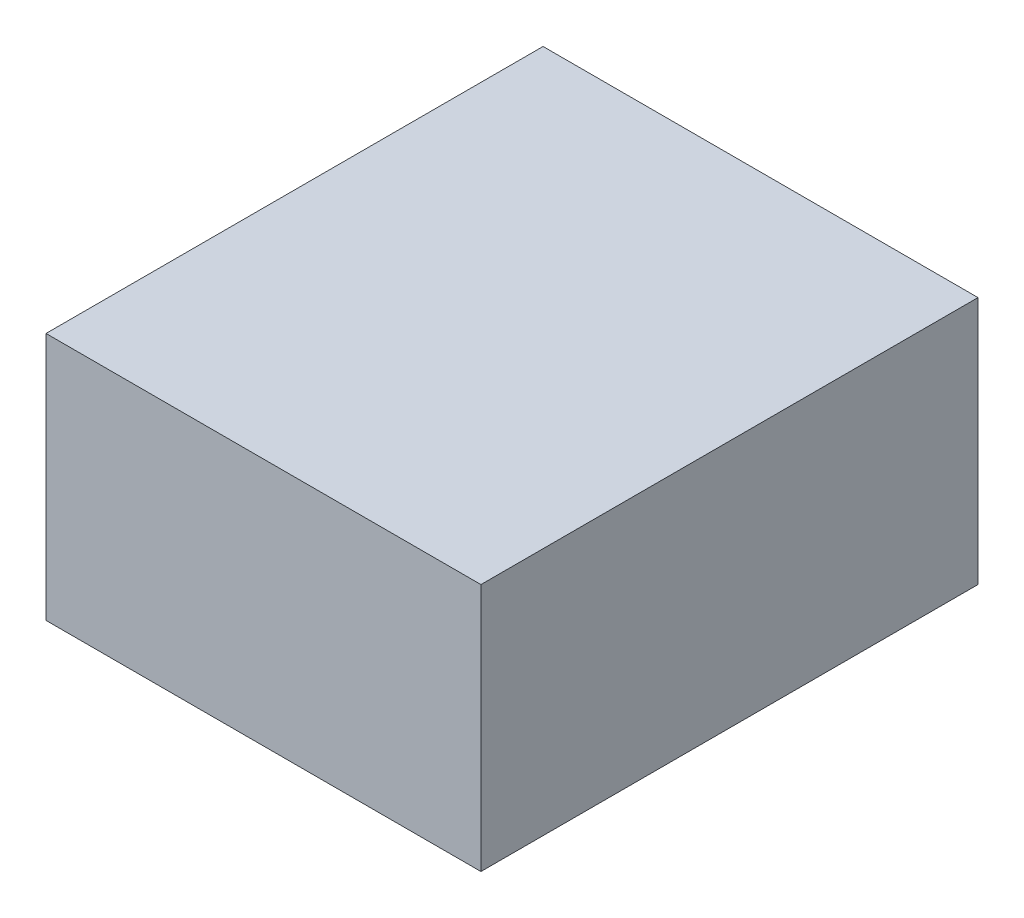
ISO-10303-21;
HEADER;
FILE_DESCRIPTION(('STEP AP214'),'2;1');
FILE_NAME('part.step','',(''),(''),'','','');
FILE_SCHEMA(('AUTOMOTIVE_DESIGN { 1 0 10303 214 1 1 1 1 }'));
ENDSEC;
DATA;
#1=APPLICATION_CONTEXT('core data for automotive mechanical design processes');
#2=APPLICATION_PROTOCOL_DEFINITION('international standard','automotive_design',2000,#1);
#3=PRODUCT_CONTEXT('',#1,'mechanical');
#4=PRODUCT('Part','Part','',(#3));
#5=PRODUCT_RELATED_PRODUCT_CATEGORY('part','',(#4));
#6=PRODUCT_DEFINITION_FORMATION('','',#4);
#7=PRODUCT_DEFINITION_CONTEXT('part definition',#1,'design');
#8=PRODUCT_DEFINITION('design','',#6,#7);
#9=PRODUCT_DEFINITION_SHAPE('','',#8);
#10=(LENGTH_UNIT() NAMED_UNIT(*) SI_UNIT(.MILLI.,.METRE.));
#11=(NAMED_UNIT(*) PLANE_ANGLE_UNIT() SI_UNIT($,.RADIAN.));
#12=(NAMED_UNIT(*) SI_UNIT($,.STERADIAN.) SOLID_ANGLE_UNIT());
#13=UNCERTAINTY_MEASURE_WITH_UNIT(LENGTH_MEASURE(1.E-05),#10,'distance_accuracy_value','');
#14=(GEOMETRIC_REPRESENTATION_CONTEXT(3) GLOBAL_UNCERTAINTY_ASSIGNED_CONTEXT((#13)) GLOBAL_UNIT_ASSIGNED_CONTEXT((#10,
#11,#12)) REPRESENTATION_CONTEXT('',''));
#15=CARTESIAN_POINT('',(0.,0.,0.));
#16=DIRECTION('',(0.,0.,1.));
#17=DIRECTION('',(1.,0.,0.));
#18=AXIS2_PLACEMENT_3D('',#15,#16,#17);
#19=CARTESIAN_POINT('',(8.475,-0.85,-51.6));
#20=DIRECTION('',(0.,1.,0.));
#21=DIRECTION('',(0.,0.,1.));
#22=AXIS2_PLACEMENT_3D('',#19,#20,#21);
#23=PLANE('',#22);
#24=DIRECTION('',(-1.,0.,0.));
#25=VECTOR('',#24,1.);
#26=CARTESIAN_POINT('',(10.4,-0.85,-47.2));
#27=LINE('',#26,#25);
#28=CARTESIAN_POINT('',(12.325,-0.85,-47.2));
#29=VERTEX_POINT('',#28);
#30=CARTESIAN_POINT('',(8.475,-0.85,-47.2));
#31=VERTEX_POINT('',#30);
#32=EDGE_CURVE('E54',#29,#31,#27,.T.);
#33=ORIENTED_EDGE('',*,*,#32,.F.);
#34=DIRECTION('',(0.,0.,1.));
#35=VECTOR('',#34,1.);
#36=CARTESIAN_POINT('',(12.325,-0.85,-49.4));
#37=LINE('',#36,#35);
#38=CARTESIAN_POINT('',(12.325,-0.85,-51.6));
#39=VERTEX_POINT('',#38);
#40=EDGE_CURVE('E69',#39,#29,#37,.T.);
#41=ORIENTED_EDGE('',*,*,#40,.F.);
#42=DIRECTION('',(1.,0.,0.));
#43=VECTOR('',#42,1.);
#44=CARTESIAN_POINT('',(10.4,-0.85,-51.6));
#45=LINE('',#44,#43);
#46=CARTESIAN_POINT('',(8.475,-0.85,-51.6));
#47=VERTEX_POINT('',#46);
#48=EDGE_CURVE('E21',#47,#39,#45,.T.);
#49=ORIENTED_EDGE('',*,*,#48,.F.);
#50=DIRECTION('',(0.,0.,-1.));
#51=VECTOR('',#50,1.);
#52=CARTESIAN_POINT('',(8.475,-0.85,-49.4));
#53=LINE('',#52,#51);
#54=EDGE_CURVE('E59',#31,#47,#53,.T.);
#55=ORIENTED_EDGE('',*,*,#54,.F.);
#56=EDGE_LOOP('',(#33,#41,#49,#55));
#57=FACE_BOUND('',#56,.T.);
#58=ADVANCED_FACE('F17',(#57),#23,.T.);
#59=CARTESIAN_POINT('',(12.325,-3.05,-51.6));
#60=DIRECTION('',(0.,0.,-1.));
#61=DIRECTION('',(-1.,0.,0.));
#62=AXIS2_PLACEMENT_3D('',#59,#60,#61);
#63=PLANE('',#62);
#64=ORIENTED_EDGE('',*,*,#48,.T.);
#65=DIRECTION('',(0.,1.,0.));
#66=VECTOR('',#65,1.);
#67=CARTESIAN_POINT('',(12.325,-1.95,-51.6));
#68=LINE('',#67,#66);
#69=CARTESIAN_POINT('',(12.325,-3.05,-51.6));
#70=VERTEX_POINT('',#69);
#71=EDGE_CURVE('E80',#70,#39,#68,.T.);
#72=ORIENTED_EDGE('',*,*,#71,.F.);
#73=DIRECTION('',(-1.,0.,0.));
#74=VECTOR('',#73,1.);
#75=CARTESIAN_POINT('',(10.4,-3.05,-51.6));
#76=LINE('',#75,#74);
#77=CARTESIAN_POINT('',(8.475,-3.05,-51.6));
#78=VERTEX_POINT('',#77);
#79=EDGE_CURVE('E75',#70,#78,#76,.T.);
#80=ORIENTED_EDGE('',*,*,#79,.T.);
#81=DIRECTION('',(0.,-1.,0.));
#82=VECTOR('',#81,1.);
#83=CARTESIAN_POINT('',(8.475,-1.95,-51.6));
#84=LINE('',#83,#82);
#85=EDGE_CURVE('E64',#47,#78,#84,.T.);
#86=ORIENTED_EDGE('',*,*,#85,.F.);
#87=EDGE_LOOP('',(#64,#72,#80,#86));
#88=FACE_BOUND('',#87,.T.);
#89=ADVANCED_FACE('F74',(#88),#63,.T.);
#90=CARTESIAN_POINT('',(8.475,-3.05,-51.6));
#91=DIRECTION('',(-1.,0.,0.));
#92=DIRECTION('',(0.,0.,1.));
#93=AXIS2_PLACEMENT_3D('',#90,#91,#92);
#94=PLANE('',#93);
#95=ORIENTED_EDGE('',*,*,#54,.T.);
#96=ORIENTED_EDGE('',*,*,#85,.T.);
#97=DIRECTION('',(0.,0.,1.));
#98=VECTOR('',#97,1.);
#99=CARTESIAN_POINT('',(8.475,-3.05,-49.4));
#100=LINE('',#99,#98);
#101=CARTESIAN_POINT('',(8.475,-3.05,-47.2));
#102=VERTEX_POINT('',#101);
#103=EDGE_CURVE('E85',#78,#102,#100,.T.);
#104=ORIENTED_EDGE('',*,*,#103,.T.);
#105=DIRECTION('',(0.,-1.,0.));
#106=VECTOR('',#105,1.);
#107=CARTESIAN_POINT('',(8.475,-1.95,-47.2));
#108=LINE('',#107,#106);
#109=EDGE_CURVE('E66',#31,#102,#108,.T.);
#110=ORIENTED_EDGE('',*,*,#109,.F.);
#111=EDGE_LOOP('',(#95,#96,#104,#110));
#112=FACE_BOUND('',#111,.T.);
#113=ADVANCED_FACE('F61',(#112),#94,.T.);
#114=CARTESIAN_POINT('',(8.475,-3.05,-47.2));
#115=DIRECTION('',(0.,0.,1.));
#116=DIRECTION('',(1.,0.,0.));
#117=AXIS2_PLACEMENT_3D('',#114,#115,#116);
#118=PLANE('',#117);
#119=ORIENTED_EDGE('',*,*,#32,.T.);
#120=ORIENTED_EDGE('',*,*,#109,.T.);
#121=DIRECTION('',(1.,0.,0.));
#122=VECTOR('',#121,1.);
#123=CARTESIAN_POINT('',(10.4,-3.05,-47.2));
#124=LINE('',#123,#122);
#125=CARTESIAN_POINT('',(12.325,-3.05,-47.2));
#126=VERTEX_POINT('',#125);
#127=EDGE_CURVE('E27',#102,#126,#124,.T.);
#128=ORIENTED_EDGE('',*,*,#127,.T.);
#129=DIRECTION('',(0.,-1.,0.));
#130=VECTOR('',#129,1.);
#131=CARTESIAN_POINT('',(12.325,-1.95,-47.2));
#132=LINE('',#131,#130);
#133=EDGE_CURVE('E35',#29,#126,#132,.T.);
#134=ORIENTED_EDGE('',*,*,#133,.F.);
#135=EDGE_LOOP('',(#119,#120,#128,#134));
#136=FACE_BOUND('',#135,.T.);
#137=ADVANCED_FACE('F89',(#136),#118,.T.);
#138=CARTESIAN_POINT('',(12.325,-3.05,-47.2));
#139=DIRECTION('',(1.,0.,0.));
#140=DIRECTION('',(0.,0.,-1.));
#141=AXIS2_PLACEMENT_3D('',#138,#139,#140);
#142=PLANE('',#141);
#143=ORIENTED_EDGE('',*,*,#40,.T.);
#144=ORIENTED_EDGE('',*,*,#133,.T.);
#145=DIRECTION('',(0.,0.,-1.));
#146=VECTOR('',#145,1.);
#147=CARTESIAN_POINT('',(12.325,-3.05,-49.4));
#148=LINE('',#147,#146);
#149=EDGE_CURVE('E11',#126,#70,#148,.T.);
#150=ORIENTED_EDGE('',*,*,#149,.T.);
#151=ORIENTED_EDGE('',*,*,#71,.T.);
#152=EDGE_LOOP('',(#143,#144,#150,#151));
#153=FACE_BOUND('',#152,.T.);
#154=ADVANCED_FACE('F91',(#153),#142,.T.);
#155=CARTESIAN_POINT('',(8.475,-3.05,-51.6));
#156=DIRECTION('',(0.,1.,0.));
#157=DIRECTION('',(0.,0.,1.));
#158=AXIS2_PLACEMENT_3D('',#155,#156,#157);
#159=PLANE('',#158);
#160=ORIENTED_EDGE('',*,*,#127,.F.);
#161=ORIENTED_EDGE('',*,*,#103,.F.);
#162=ORIENTED_EDGE('',*,*,#79,.F.);
#163=ORIENTED_EDGE('',*,*,#149,.F.);
#164=EDGE_LOOP('',(#160,#161,#162,#163));
#165=FACE_BOUND('',#164,.T.);
#166=ADVANCED_FACE('F19',(#165),#159,.F.);
#167=CLOSED_SHELL('',(#58,#89,#113,#137,#154,#166));
#168=MANIFOLD_SOLID_BREP('B1',#167);
#169=ADVANCED_BREP_SHAPE_REPRESENTATION('',(#18,#168),#14);
#170=SHAPE_DEFINITION_REPRESENTATION(#9,#169);
ENDSEC;
END-ISO-10303-21;
